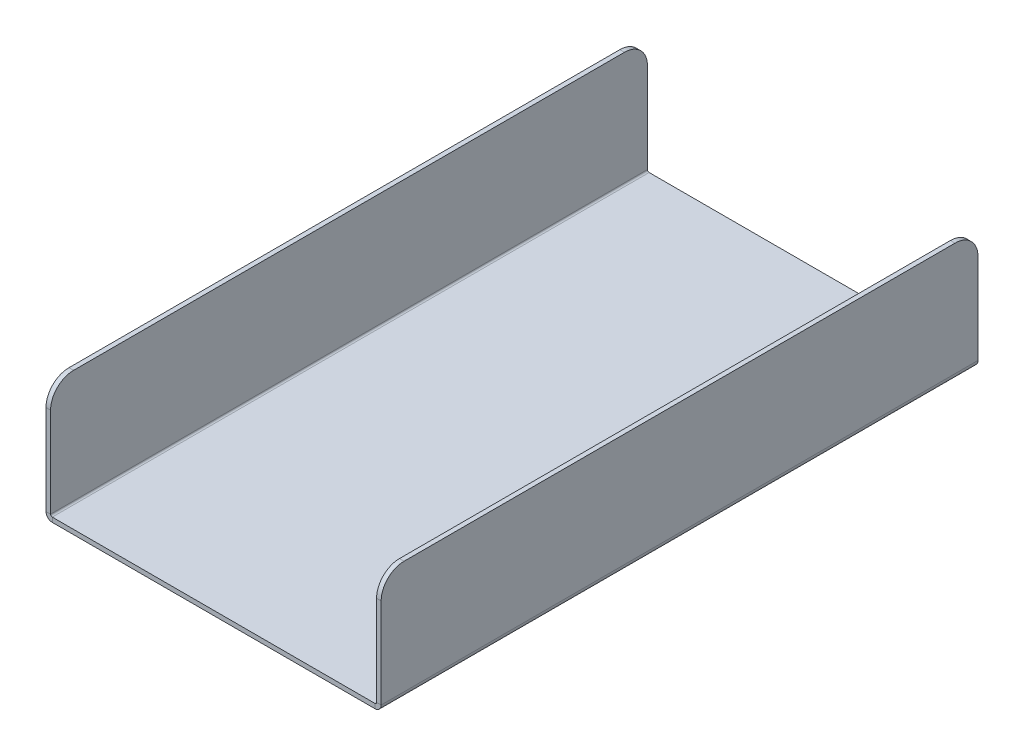
ISO-10303-21;
HEADER;
FILE_DESCRIPTION(('STEP AP214'),'2;1');
FILE_NAME('part.step','',(''),(''),'','','');
FILE_SCHEMA(('AUTOMOTIVE_DESIGN { 1 0 10303 214 1 1 1 1 }'));
ENDSEC;
DATA;
#1=APPLICATION_CONTEXT('core data for automotive mechanical design processes');
#2=APPLICATION_PROTOCOL_DEFINITION('international standard','automotive_design',2000,#1);
#3=PRODUCT_CONTEXT('',#1,'mechanical');
#4=PRODUCT('Part','Part','',(#3));
#5=PRODUCT_RELATED_PRODUCT_CATEGORY('part','',(#4));
#6=PRODUCT_DEFINITION_FORMATION('','',#4);
#7=PRODUCT_DEFINITION_CONTEXT('part definition',#1,'design');
#8=PRODUCT_DEFINITION('design','',#6,#7);
#9=PRODUCT_DEFINITION_SHAPE('','',#8);
#10=(LENGTH_UNIT() NAMED_UNIT(*) SI_UNIT(.MILLI.,.METRE.));
#11=(NAMED_UNIT(*) PLANE_ANGLE_UNIT() SI_UNIT($,.RADIAN.));
#12=(NAMED_UNIT(*) SI_UNIT($,.STERADIAN.) SOLID_ANGLE_UNIT());
#13=UNCERTAINTY_MEASURE_WITH_UNIT(LENGTH_MEASURE(1.E-05),#10,'distance_accuracy_value','');
#14=(GEOMETRIC_REPRESENTATION_CONTEXT(3) GLOBAL_UNCERTAINTY_ASSIGNED_CONTEXT((#13)) GLOBAL_UNIT_ASSIGNED_CONTEXT((#10,
#11,#12)) REPRESENTATION_CONTEXT('',''));
#15=CARTESIAN_POINT('',(0.,0.,0.));
#16=DIRECTION('',(0.,0.,1.));
#17=DIRECTION('',(1.,0.,0.));
#18=AXIS2_PLACEMENT_3D('',#15,#16,#17);
#19=CARTESIAN_POINT('',(-141.2634,0.,260.));
#20=DIRECTION('',(0.,0.,1.));
#21=DIRECTION('',(1.,0.,0.));
#22=AXIS2_PLACEMENT_3D('',#19,#20,#21);
#23=PLANE('',#22);
#24=DIRECTION('',(0.,-1.,0.));
#25=VECTOR('',#24,1.);
#26=CARTESIAN_POINT('',(-141.2634,0.,260.));
#27=LINE('',#26,#25);
#28=CARTESIAN_POINT('',(-141.2634,0.,260.));
#29=VERTEX_POINT('',#28);
#30=CARTESIAN_POINT('',(-141.2634,-2.,260.));
#31=VERTEX_POINT('',#30);
#32=EDGE_CURVE('E275',#29,#31,#27,.T.);
#33=ORIENTED_EDGE('',*,*,#32,.F.);
#34=CARTESIAN_POINT('',(-141.2634,0.736599999999998,260.));
#35=DIRECTION('',(0.,0.,-1.));
#36=DIRECTION('',(-1.,0.,0.));
#37=AXIS2_PLACEMENT_3D('',#34,#35,#36);
#38=CIRCLE('',#37,0.7366);
#39=CARTESIAN_POINT('',(-142.,0.736599999999997,260.));
#40=VERTEX_POINT('',#39);
#41=EDGE_CURVE('E192',#40,#29,#38,.F.);
#42=ORIENTED_EDGE('',*,*,#41,.F.);
#43=DIRECTION('',(1.,0.,0.));
#44=VECTOR('',#43,1.);
#45=CARTESIAN_POINT('',(-144.,0.736599999999994,260.));
#46=LINE('',#45,#44);
#47=CARTESIAN_POINT('',(-144.,0.736599999999994,260.));
#48=VERTEX_POINT('',#47);
#49=EDGE_CURVE('E272',#48,#40,#46,.T.);
#50=ORIENTED_EDGE('',*,*,#49,.F.);
#51=CARTESIAN_POINT('',(-141.2634,0.736599999999998,260.));
#52=DIRECTION('',(0.,0.,1.));
#53=DIRECTION('',(1.,0.,0.));
#54=AXIS2_PLACEMENT_3D('',#51,#52,#53);
#55=CIRCLE('',#54,2.7366);
#56=EDGE_CURVE('E202',#48,#31,#55,.T.);
#57=ORIENTED_EDGE('',*,*,#56,.T.);
#58=EDGE_LOOP('',(#33,#42,#50,#57));
#59=FACE_BOUND('',#58,.T.);
#60=ADVANCED_FACE('F36',(#59),#23,.T.);
#61=CARTESIAN_POINT('',(-144.,0.736599999999994,260.));
#62=DIRECTION('',(0.,0.,1.));
#63=DIRECTION('',(1.,0.,0.));
#64=AXIS2_PLACEMENT_3D('',#61,#62,#63);
#65=PLANE('',#64);
#66=DIRECTION('',(1.,0.,0.));
#67=VECTOR('',#66,1.);
#68=CARTESIAN_POINT('',(-142.,0.,260.));
#69=LINE('',#68,#67);
#70=CARTESIAN_POINT('',(-0.736600000000004,0.,260.));
#71=VERTEX_POINT('',#70);
#72=EDGE_CURVE('E190',#29,#71,#69,.T.);
#73=ORIENTED_EDGE('',*,*,#72,.F.);
#74=ORIENTED_EDGE('',*,*,#32,.T.);
#75=DIRECTION('',(1.,0.,0.));
#76=VECTOR('',#75,1.);
#77=CARTESIAN_POINT('',(-142.,-2.,260.));
#78=LINE('',#77,#76);
#79=CARTESIAN_POINT('',(-0.73660000000001,-2.,260.));
#80=VERTEX_POINT('',#79);
#81=EDGE_CURVE('E205',#31,#80,#78,.T.);
#82=ORIENTED_EDGE('',*,*,#81,.T.);
#83=DIRECTION('',(0.,1.,0.));
#84=VECTOR('',#83,1.);
#85=CARTESIAN_POINT('',(-0.73660000000001,-2.,260.));
#86=LINE('',#85,#84);
#87=EDGE_CURVE('E164',#80,#71,#86,.T.);
#88=ORIENTED_EDGE('',*,*,#87,.T.);
#89=EDGE_LOOP('',(#73,#74,#82,#88));
#90=FACE_BOUND('',#89,.T.);
#91=ADVANCED_FACE('F343',(#90),#65,.T.);
#92=CARTESIAN_POINT('',(-142.,0.736599999999997,0.));
#93=DIRECTION('',(0.,0.,-1.));
#94=DIRECTION('',(-1.,0.,0.));
#95=AXIS2_PLACEMENT_3D('',#92,#93,#94);
#96=PLANE('',#95);
#97=DIRECTION('',(-1.,0.,0.));
#98=VECTOR('',#97,1.);
#99=CARTESIAN_POINT('',(-142.,0.736599999999997,0.));
#100=LINE('',#99,#98);
#101=CARTESIAN_POINT('',(-142.,0.736599999999997,0.));
#102=VERTEX_POINT('',#101);
#103=CARTESIAN_POINT('',(-144.,0.736599999999994,0.));
#104=VERTEX_POINT('',#103);
#105=EDGE_CURVE('E269',#102,#104,#100,.T.);
#106=ORIENTED_EDGE('',*,*,#105,.F.);
#107=CARTESIAN_POINT('',(-141.2634,0.736599999999998,0.));
#108=DIRECTION('',(0.,0.,-1.));
#109=DIRECTION('',(-1.,0.,0.));
#110=AXIS2_PLACEMENT_3D('',#107,#108,#109);
#111=CIRCLE('',#110,0.7366);
#112=CARTESIAN_POINT('',(-141.2634,0.,0.));
#113=VERTEX_POINT('',#112);
#114=EDGE_CURVE('E219',#102,#113,#111,.F.);
#115=ORIENTED_EDGE('',*,*,#114,.T.);
#116=DIRECTION('',(0.,1.,0.));
#117=VECTOR('',#116,1.);
#118=CARTESIAN_POINT('',(-141.2634,-2.,0.));
#119=LINE('',#118,#117);
#120=CARTESIAN_POINT('',(-141.2634,-2.,0.));
#121=VERTEX_POINT('',#120);
#122=EDGE_CURVE('E163',#121,#113,#119,.T.);
#123=ORIENTED_EDGE('',*,*,#122,.F.);
#124=CARTESIAN_POINT('',(-141.2634,0.736599999999998,0.));
#125=DIRECTION('',(0.,0.,1.));
#126=DIRECTION('',(1.,0.,0.));
#127=AXIS2_PLACEMENT_3D('',#124,#125,#126);
#128=CIRCLE('',#127,2.7366);
#129=EDGE_CURVE('E226',#104,#121,#128,.T.);
#130=ORIENTED_EDGE('',*,*,#129,.F.);
#131=EDGE_LOOP('',(#106,#115,#123,#130));
#132=FACE_BOUND('',#131,.T.);
#133=ADVANCED_FACE('F331',(#132),#96,.T.);
#134=CARTESIAN_POINT('',(-141.2634,-2.,0.));
#135=DIRECTION('',(0.,0.,-1.));
#136=DIRECTION('',(-1.,0.,0.));
#137=AXIS2_PLACEMENT_3D('',#134,#135,#136);
#138=PLANE('',#137);
#139=DIRECTION('',(0.,1.,0.));
#140=VECTOR('',#139,1.);
#141=CARTESIAN_POINT('',(-144.,50.,0.));
#142=LINE('',#141,#140);
#143=CARTESIAN_POINT('',(-144.,40.,0.));
#144=VERTEX_POINT('',#143);
#145=EDGE_CURVE('E224',#144,#104,#142,.F.);
#146=ORIENTED_EDGE('',*,*,#145,.F.);
#147=DIRECTION('',(1.,0.,0.));
#148=VECTOR('',#147,1.);
#149=CARTESIAN_POINT('',(-141.2634,40.,0.));
#150=LINE('',#149,#148);
#151=CARTESIAN_POINT('',(-142.,40.,0.));
#152=VERTEX_POINT('',#151);
#153=EDGE_CURVE('E11',#144,#152,#150,.T.);
#154=ORIENTED_EDGE('',*,*,#153,.T.);
#155=DIRECTION('',(0.,-1.,0.));
#156=VECTOR('',#155,1.);
#157=CARTESIAN_POINT('',(-142.,50.,0.));
#158=LINE('',#157,#156);
#159=EDGE_CURVE('E222',#152,#102,#158,.T.);
#160=ORIENTED_EDGE('',*,*,#159,.T.);
#161=ORIENTED_EDGE('',*,*,#105,.T.);
#162=EDGE_LOOP('',(#146,#154,#160,#161));
#163=FACE_BOUND('',#162,.T.);
#164=ADVANCED_FACE('F353',(#163),#138,.T.);
#165=CARTESIAN_POINT('',(0.,0.7366,260.));
#166=DIRECTION('',(0.,0.,1.));
#167=DIRECTION('',(1.,0.,0.));
#168=AXIS2_PLACEMENT_3D('',#165,#166,#167);
#169=PLANE('',#168);
#170=DIRECTION('',(1.,0.,0.));
#171=VECTOR('',#170,1.);
#172=CARTESIAN_POINT('',(0.,0.7366,260.));
#173=LINE('',#172,#171);
#174=CARTESIAN_POINT('',(0.,0.7366,260.));
#175=VERTEX_POINT('',#174);
#176=CARTESIAN_POINT('',(2.,0.7366,260.));
#177=VERTEX_POINT('',#176);
#178=EDGE_CURVE('E151',#175,#177,#173,.T.);
#179=ORIENTED_EDGE('',*,*,#178,.F.);
#180=CARTESIAN_POINT('',(-0.736600000000002,0.7366,260.));
#181=DIRECTION('',(0.,0.,-1.));
#182=DIRECTION('',(-1.,0.,0.));
#183=AXIS2_PLACEMENT_3D('',#180,#181,#182);
#184=CIRCLE('',#183,0.7366);
#185=EDGE_CURVE('E155',#71,#175,#184,.F.);
#186=ORIENTED_EDGE('',*,*,#185,.F.);
#187=ORIENTED_EDGE('',*,*,#87,.F.);
#188=CARTESIAN_POINT('',(-0.736600000000002,0.7366,260.));
#189=DIRECTION('',(0.,0.,1.));
#190=DIRECTION('',(1.,0.,0.));
#191=AXIS2_PLACEMENT_3D('',#188,#189,#190);
#192=CIRCLE('',#191,2.7366);
#193=EDGE_CURVE('E158',#80,#177,#192,.T.);
#194=ORIENTED_EDGE('',*,*,#193,.T.);
#195=EDGE_LOOP('',(#179,#186,#187,#194));
#196=FACE_BOUND('',#195,.T.);
#197=ADVANCED_FACE('F153',(#196),#169,.T.);
#198=CARTESIAN_POINT('',(-0.73660000000001,-2.,260.));
#199=DIRECTION('',(0.,0.,1.));
#200=DIRECTION('',(1.,0.,0.));
#201=AXIS2_PLACEMENT_3D('',#198,#199,#200);
#202=PLANE('',#201);
#203=DIRECTION('',(0.,1.,0.));
#204=VECTOR('',#203,1.);
#205=CARTESIAN_POINT('',(2.,0.,260.));
#206=LINE('',#205,#204);
#207=CARTESIAN_POINT('',(2.,40.,260.));
#208=VERTEX_POINT('',#207);
#209=EDGE_CURVE('E185',#177,#208,#206,.T.);
#210=ORIENTED_EDGE('',*,*,#209,.T.);
#211=DIRECTION('',(1.,0.,0.));
#212=VECTOR('',#211,1.);
#213=CARTESIAN_POINT('',(-0.73660000000001,40.,260.));
#214=LINE('',#213,#212);
#215=CARTESIAN_POINT('',(0.,40.,260.));
#216=VERTEX_POINT('',#215);
#217=EDGE_CURVE('E184',#208,#216,#214,.F.);
#218=ORIENTED_EDGE('',*,*,#217,.T.);
#219=DIRECTION('',(0.,1.,0.));
#220=VECTOR('',#219,1.);
#221=CARTESIAN_POINT('',(0.,0.,260.));
#222=LINE('',#221,#220);
#223=EDGE_CURVE('E172',#175,#216,#222,.T.);
#224=ORIENTED_EDGE('',*,*,#223,.F.);
#225=ORIENTED_EDGE('',*,*,#178,.T.);
#226=EDGE_LOOP('',(#210,#218,#224,#225));
#227=FACE_BOUND('',#226,.T.);
#228=ADVANCED_FACE('F182',(#227),#202,.T.);
#229=CARTESIAN_POINT('',(-0.736600000000004,0.,0.));
#230=DIRECTION('',(0.,0.,-1.));
#231=DIRECTION('',(-1.,0.,0.));
#232=AXIS2_PLACEMENT_3D('',#229,#230,#231);
#233=PLANE('',#232);
#234=DIRECTION('',(0.,-1.,0.));
#235=VECTOR('',#234,1.);
#236=CARTESIAN_POINT('',(-0.736600000000004,0.,0.));
#237=LINE('',#236,#235);
#238=CARTESIAN_POINT('',(-0.736600000000004,0.,0.));
#239=VERTEX_POINT('',#238);
#240=CARTESIAN_POINT('',(-0.73660000000001,-2.,0.));
#241=VERTEX_POINT('',#240);
#242=EDGE_CURVE('E265',#239,#241,#237,.T.);
#243=ORIENTED_EDGE('',*,*,#242,.F.);
#244=CARTESIAN_POINT('',(-0.736600000000002,0.7366,0.));
#245=DIRECTION('',(0.,0.,-1.));
#246=DIRECTION('',(-1.,0.,0.));
#247=AXIS2_PLACEMENT_3D('',#244,#245,#246);
#248=CIRCLE('',#247,0.7366);
#249=CARTESIAN_POINT('',(0.,0.7366,0.));
#250=VERTEX_POINT('',#249);
#251=EDGE_CURVE('E214',#239,#250,#248,.F.);
#252=ORIENTED_EDGE('',*,*,#251,.T.);
#253=DIRECTION('',(-1.,0.,0.));
#254=VECTOR('',#253,1.);
#255=CARTESIAN_POINT('',(2.,0.7366,0.));
#256=LINE('',#255,#254);
#257=CARTESIAN_POINT('',(2.,0.7366,0.));
#258=VERTEX_POINT('',#257);
#259=EDGE_CURVE('E263',#258,#250,#256,.T.);
#260=ORIENTED_EDGE('',*,*,#259,.F.);
#261=CARTESIAN_POINT('',(-0.736600000000002,0.7366,0.));
#262=DIRECTION('',(0.,0.,1.));
#263=DIRECTION('',(1.,0.,0.));
#264=AXIS2_PLACEMENT_3D('',#261,#262,#263);
#265=CIRCLE('',#264,2.7366);
#266=EDGE_CURVE('E232',#241,#258,#265,.T.);
#267=ORIENTED_EDGE('',*,*,#266,.F.);
#268=EDGE_LOOP('',(#243,#252,#260,#267));
#269=FACE_BOUND('',#268,.T.);
#270=ADVANCED_FACE('F319',(#269),#233,.T.);
#271=CARTESIAN_POINT('',(2.,0.7366,0.));
#272=DIRECTION('',(0.,0.,-1.));
#273=DIRECTION('',(-1.,0.,0.));
#274=AXIS2_PLACEMENT_3D('',#271,#272,#273);
#275=PLANE('',#274);
#276=DIRECTION('',(1.,0.,0.));
#277=VECTOR('',#276,1.);
#278=CARTESIAN_POINT('',(-142.,0.,0.));
#279=LINE('',#278,#277);
#280=EDGE_CURVE('E216',#113,#239,#279,.T.);
#281=ORIENTED_EDGE('',*,*,#280,.T.);
#282=ORIENTED_EDGE('',*,*,#242,.T.);
#283=DIRECTION('',(1.,0.,0.));
#284=VECTOR('',#283,1.);
#285=CARTESIAN_POINT('',(-142.,-2.,0.));
#286=LINE('',#285,#284);
#287=EDGE_CURVE('E229',#121,#241,#286,.T.);
#288=ORIENTED_EDGE('',*,*,#287,.F.);
#289=ORIENTED_EDGE('',*,*,#122,.T.);
#290=EDGE_LOOP('',(#281,#282,#288,#289));
#291=FACE_BOUND('',#290,.T.);
#292=ADVANCED_FACE('F322',(#291),#275,.T.);
#293=CARTESIAN_POINT('',(2.,0.,260.));
#294=DIRECTION('',(-1.,0.,0.));
#295=DIRECTION('',(0.,0.,1.));
#296=AXIS2_PLACEMENT_3D('',#293,#294,#295);
#297=PLANE('',#296);
#298=DIRECTION('',(0.,0.,-1.));
#299=VECTOR('',#298,1.);
#300=CARTESIAN_POINT('',(2.,50.,260.));
#301=LINE('',#300,#299);
#302=CARTESIAN_POINT('',(2.,50.,250.));
#303=VERTEX_POINT('',#302);
#304=CARTESIAN_POINT('',(2.,50.,10.));
#305=VERTEX_POINT('',#304);
#306=EDGE_CURVE('E260',#303,#305,#301,.T.);
#307=ORIENTED_EDGE('',*,*,#306,.F.);
#308=CARTESIAN_POINT('',(2.,40.,250.));
#309=DIRECTION('',(-1.,0.,0.));
#310=DIRECTION('',(0.,0.,1.));
#311=AXIS2_PLACEMENT_3D('',#308,#309,#310);
#312=CIRCLE('',#311,10.);
#313=EDGE_CURVE('E284',#303,#208,#312,.F.);
#314=ORIENTED_EDGE('',*,*,#313,.T.);
#315=ORIENTED_EDGE('',*,*,#209,.F.);
#316=DIRECTION('',(0.,0.,-1.));
#317=VECTOR('',#316,1.);
#318=CARTESIAN_POINT('',(2.,0.7366,260.));
#319=LINE('',#318,#317);
#320=EDGE_CURVE('E209',#177,#258,#319,.T.);
#321=ORIENTED_EDGE('',*,*,#320,.T.);
#322=DIRECTION('',(0.,1.,0.));
#323=VECTOR('',#322,1.);
#324=CARTESIAN_POINT('',(2.,0.,0.));
#325=LINE('',#324,#323);
#326=CARTESIAN_POINT('',(2.,40.,0.));
#327=VERTEX_POINT('',#326);
#328=EDGE_CURVE('E210',#258,#327,#325,.T.);
#329=ORIENTED_EDGE('',*,*,#328,.T.);
#330=CARTESIAN_POINT('',(2.,40.,10.));
#331=DIRECTION('',(-1.,0.,0.));
#332=DIRECTION('',(0.,0.,1.));
#333=AXIS2_PLACEMENT_3D('',#330,#331,#332);
#334=CIRCLE('',#333,10.);
#335=EDGE_CURVE('E282',#327,#305,#334,.F.);
#336=ORIENTED_EDGE('',*,*,#335,.T.);
#337=EDGE_LOOP('',(#307,#314,#315,#321,#329,#336));
#338=FACE_BOUND('',#337,.T.);
#339=ADVANCED_FACE('F312',(#338),#297,.F.);
#340=CARTESIAN_POINT('',(0.,50.,260.));
#341=DIRECTION('',(0.,1.,0.));
#342=DIRECTION('',(0.,0.,1.));
#343=AXIS2_PLACEMENT_3D('',#340,#341,#342);
#344=PLANE('',#343);
#345=DIRECTION('',(0.,0.,-1.));
#346=VECTOR('',#345,1.);
#347=CARTESIAN_POINT('',(0.,50.,260.));
#348=LINE('',#347,#346);
#349=CARTESIAN_POINT('',(0.,50.,250.));
#350=VERTEX_POINT('',#349);
#351=CARTESIAN_POINT('',(0.,50.,10.));
#352=VERTEX_POINT('',#351);
#353=EDGE_CURVE('E179',#350,#352,#348,.T.);
#354=ORIENTED_EDGE('',*,*,#353,.F.);
#355=DIRECTION('',(1.,0.,0.));
#356=VECTOR('',#355,1.);
#357=CARTESIAN_POINT('',(0.,50.,250.));
#358=LINE('',#357,#356);
#359=EDGE_CURVE('E279',#350,#303,#358,.T.);
#360=ORIENTED_EDGE('',*,*,#359,.T.);
#361=ORIENTED_EDGE('',*,*,#306,.T.);
#362=DIRECTION('',(1.,0.,0.));
#363=VECTOR('',#362,1.);
#364=CARTESIAN_POINT('',(0.,50.,10.));
#365=LINE('',#364,#363);
#366=EDGE_CURVE('E277',#305,#352,#365,.F.);
#367=ORIENTED_EDGE('',*,*,#366,.T.);
#368=EDGE_LOOP('',(#354,#360,#361,#367));
#369=FACE_BOUND('',#368,.T.);
#370=ADVANCED_FACE('F393',(#369),#344,.T.);
#371=CARTESIAN_POINT('',(0.,0.,260.));
#372=DIRECTION('',(-1.,0.,0.));
#373=DIRECTION('',(0.,0.,1.));
#374=AXIS2_PLACEMENT_3D('',#371,#372,#373);
#375=PLANE('',#374);
#376=ORIENTED_EDGE('',*,*,#223,.T.);
#377=CARTESIAN_POINT('',(0.,40.,250.));
#378=DIRECTION('',(-1.,0.,0.));
#379=DIRECTION('',(0.,0.,1.));
#380=AXIS2_PLACEMENT_3D('',#377,#378,#379);
#381=CIRCLE('',#380,10.);
#382=EDGE_CURVE('E289',#216,#350,#381,.T.);
#383=ORIENTED_EDGE('',*,*,#382,.T.);
#384=ORIENTED_EDGE('',*,*,#353,.T.);
#385=CARTESIAN_POINT('',(0.,40.,10.));
#386=DIRECTION('',(-1.,0.,0.));
#387=DIRECTION('',(0.,0.,1.));
#388=AXIS2_PLACEMENT_3D('',#385,#386,#387);
#389=CIRCLE('',#388,10.);
#390=CARTESIAN_POINT('',(0.,40.,0.));
#391=VERTEX_POINT('',#390);
#392=EDGE_CURVE('E287',#352,#391,#389,.T.);
#393=ORIENTED_EDGE('',*,*,#392,.T.);
#394=DIRECTION('',(0.,1.,0.));
#395=VECTOR('',#394,1.);
#396=CARTESIAN_POINT('',(0.,0.,0.));
#397=LINE('',#396,#395);
#398=EDGE_CURVE('E175',#250,#391,#397,.T.);
#399=ORIENTED_EDGE('',*,*,#398,.F.);
#400=DIRECTION('',(0.,0.,-1.));
#401=VECTOR('',#400,1.);
#402=CARTESIAN_POINT('',(0.,0.7366,260.));
#403=LINE('',#402,#401);
#404=EDGE_CURVE('E170',#175,#250,#403,.T.);
#405=ORIENTED_EDGE('',*,*,#404,.F.);
#406=EDGE_LOOP('',(#376,#383,#384,#393,#399,#405));
#407=FACE_BOUND('',#406,.T.);
#408=ADVANCED_FACE('F171',(#407),#375,.T.);
#409=CARTESIAN_POINT('',(-0.736600000000002,0.7366,260.));
#410=DIRECTION('',(0.,0.,-1.));
#411=DIRECTION('',(-1.,0.,0.));
#412=AXIS2_PLACEMENT_3D('',#409,#410,#411);
#413=CYLINDRICAL_SURFACE('',#412,0.7366);
#414=ORIENTED_EDGE('',*,*,#251,.F.);
#415=DIRECTION('',(0.,0.,-1.));
#416=VECTOR('',#415,1.);
#417=CARTESIAN_POINT('',(-0.736600000000004,0.,260.));
#418=LINE('',#417,#416);
#419=EDGE_CURVE('E180',#71,#239,#418,.T.);
#420=ORIENTED_EDGE('',*,*,#419,.F.);
#421=ORIENTED_EDGE('',*,*,#185,.T.);
#422=ORIENTED_EDGE('',*,*,#404,.T.);
#423=EDGE_LOOP('',(#414,#420,#421,#422));
#424=FACE_BOUND('',#423,.T.);
#425=ADVANCED_FACE('F188',(#424),#413,.F.);
#426=CARTESIAN_POINT('',(-142.,0.,260.));
#427=DIRECTION('',(0.,1.,0.));
#428=DIRECTION('',(0.,0.,1.));
#429=AXIS2_PLACEMENT_3D('',#426,#427,#428);
#430=PLANE('',#429);
#431=ORIENTED_EDGE('',*,*,#280,.F.);
#432=DIRECTION('',(0.,0.,-1.));
#433=VECTOR('',#432,1.);
#434=CARTESIAN_POINT('',(-141.2634,0.,260.));
#435=LINE('',#434,#433);
#436=EDGE_CURVE('E254',#29,#113,#435,.T.);
#437=ORIENTED_EDGE('',*,*,#436,.F.);
#438=ORIENTED_EDGE('',*,*,#72,.T.);
#439=ORIENTED_EDGE('',*,*,#419,.T.);
#440=EDGE_LOOP('',(#431,#437,#438,#439));
#441=FACE_BOUND('',#440,.T.);
#442=ADVANCED_FACE('F326',(#441),#430,.T.);
#443=CARTESIAN_POINT('',(-141.2634,0.736599999999998,260.));
#444=DIRECTION('',(0.,0.,-1.));
#445=DIRECTION('',(-1.,0.,0.));
#446=AXIS2_PLACEMENT_3D('',#443,#444,#445);
#447=CYLINDRICAL_SURFACE('',#446,0.7366);
#448=ORIENTED_EDGE('',*,*,#114,.F.);
#449=DIRECTION('',(0.,0.,-1.));
#450=VECTOR('',#449,1.);
#451=CARTESIAN_POINT('',(-142.,0.736599999999997,260.));
#452=LINE('',#451,#450);
#453=EDGE_CURVE('E251',#40,#102,#452,.T.);
#454=ORIENTED_EDGE('',*,*,#453,.F.);
#455=ORIENTED_EDGE('',*,*,#41,.T.);
#456=ORIENTED_EDGE('',*,*,#436,.T.);
#457=EDGE_LOOP('',(#448,#454,#455,#456));
#458=FACE_BOUND('',#457,.T.);
#459=ADVANCED_FACE('F335',(#458),#447,.F.);
#460=CARTESIAN_POINT('',(-142.,50.,260.));
#461=DIRECTION('',(1.,0.,0.));
#462=DIRECTION('',(0.,0.,-1.));
#463=AXIS2_PLACEMENT_3D('',#460,#461,#462);
#464=PLANE('',#463);
#465=DIRECTION('',(0.,0.,-1.));
#466=VECTOR('',#465,1.);
#467=CARTESIAN_POINT('',(-142.,50.,260.));
#468=LINE('',#467,#466);
#469=CARTESIAN_POINT('',(-142.,50.,250.));
#470=VERTEX_POINT('',#469);
#471=CARTESIAN_POINT('',(-142.,50.,10.));
#472=VERTEX_POINT('',#471);
#473=EDGE_CURVE('E248',#470,#472,#468,.T.);
#474=ORIENTED_EDGE('',*,*,#473,.F.);
#475=CARTESIAN_POINT('',(-142.,40.,250.));
#476=DIRECTION('',(1.,0.,0.));
#477=DIRECTION('',(0.,0.,-1.));
#478=AXIS2_PLACEMENT_3D('',#475,#476,#477);
#479=CIRCLE('',#478,10.);
#480=CARTESIAN_POINT('',(-142.,40.,260.));
#481=VERTEX_POINT('',#480);
#482=EDGE_CURVE('E298',#470,#481,#479,.T.);
#483=ORIENTED_EDGE('',*,*,#482,.T.);
#484=DIRECTION('',(0.,-1.,0.));
#485=VECTOR('',#484,1.);
#486=CARTESIAN_POINT('',(-142.,50.,260.));
#487=LINE('',#486,#485);
#488=EDGE_CURVE('E198',#481,#40,#487,.T.);
#489=ORIENTED_EDGE('',*,*,#488,.T.);
#490=ORIENTED_EDGE('',*,*,#453,.T.);
#491=ORIENTED_EDGE('',*,*,#159,.F.);
#492=CARTESIAN_POINT('',(-142.,40.,10.));
#493=DIRECTION('',(1.,0.,0.));
#494=DIRECTION('',(0.,0.,-1.));
#495=AXIS2_PLACEMENT_3D('',#492,#493,#494);
#496=CIRCLE('',#495,10.);
#497=EDGE_CURVE('E296',#152,#472,#496,.T.);
#498=ORIENTED_EDGE('',*,*,#497,.T.);
#499=EDGE_LOOP('',(#474,#483,#489,#490,#491,#498));
#500=FACE_BOUND('',#499,.T.);
#501=ADVANCED_FACE('F357',(#500),#464,.T.);
#502=CARTESIAN_POINT('',(-144.,50.,260.));
#503=DIRECTION('',(0.,1.,0.));
#504=DIRECTION('',(0.,0.,1.));
#505=AXIS2_PLACEMENT_3D('',#502,#503,#504);
#506=PLANE('',#505);
#507=DIRECTION('',(0.,0.,-1.));
#508=VECTOR('',#507,1.);
#509=CARTESIAN_POINT('',(-144.,50.,260.));
#510=LINE('',#509,#508);
#511=CARTESIAN_POINT('',(-144.,50.,250.));
#512=VERTEX_POINT('',#511);
#513=CARTESIAN_POINT('',(-144.,50.,10.));
#514=VERTEX_POINT('',#513);
#515=EDGE_CURVE('E246',#512,#514,#510,.T.);
#516=ORIENTED_EDGE('',*,*,#515,.F.);
#517=DIRECTION('',(1.,0.,0.));
#518=VECTOR('',#517,1.);
#519=CARTESIAN_POINT('',(-142.,50.,250.));
#520=LINE('',#519,#518);
#521=EDGE_CURVE('E293',#512,#470,#520,.T.);
#522=ORIENTED_EDGE('',*,*,#521,.T.);
#523=ORIENTED_EDGE('',*,*,#473,.T.);
#524=DIRECTION('',(1.,0.,0.));
#525=VECTOR('',#524,1.);
#526=CARTESIAN_POINT('',(-144.,50.,10.));
#527=LINE('',#526,#525);
#528=EDGE_CURVE('E291',#472,#514,#527,.F.);
#529=ORIENTED_EDGE('',*,*,#528,.T.);
#530=EDGE_LOOP('',(#516,#522,#523,#529));
#531=FACE_BOUND('',#530,.T.);
#532=ADVANCED_FACE('F489',(#531),#506,.T.);
#533=CARTESIAN_POINT('',(-144.,50.,260.));
#534=DIRECTION('',(1.,0.,0.));
#535=DIRECTION('',(0.,0.,-1.));
#536=AXIS2_PLACEMENT_3D('',#533,#534,#535);
#537=PLANE('',#536);
#538=DIRECTION('',(0.,1.,0.));
#539=VECTOR('',#538,1.);
#540=CARTESIAN_POINT('',(-144.,50.,260.));
#541=LINE('',#540,#539);
#542=CARTESIAN_POINT('',(-144.,40.,260.));
#543=VERTEX_POINT('',#542);
#544=EDGE_CURVE('E200',#543,#48,#541,.F.);
#545=ORIENTED_EDGE('',*,*,#544,.F.);
#546=CARTESIAN_POINT('',(-144.,40.,250.));
#547=DIRECTION('',(1.,0.,0.));
#548=DIRECTION('',(0.,0.,-1.));
#549=AXIS2_PLACEMENT_3D('',#546,#547,#548);
#550=CIRCLE('',#549,10.);
#551=EDGE_CURVE('E302',#543,#512,#550,.F.);
#552=ORIENTED_EDGE('',*,*,#551,.T.);
#553=ORIENTED_EDGE('',*,*,#515,.T.);
#554=CARTESIAN_POINT('',(-144.,40.,10.));
#555=DIRECTION('',(1.,0.,0.));
#556=DIRECTION('',(0.,0.,-1.));
#557=AXIS2_PLACEMENT_3D('',#554,#555,#556);
#558=CIRCLE('',#557,10.);
#559=EDGE_CURVE('E51',#514,#144,#558,.F.);
#560=ORIENTED_EDGE('',*,*,#559,.T.);
#561=ORIENTED_EDGE('',*,*,#145,.T.);
#562=DIRECTION('',(0.,0.,-1.));
#563=VECTOR('',#562,1.);
#564=CARTESIAN_POINT('',(-144.,0.736599999999994,260.));
#565=LINE('',#564,#563);
#566=EDGE_CURVE('E243',#48,#104,#565,.T.);
#567=ORIENTED_EDGE('',*,*,#566,.F.);
#568=EDGE_LOOP('',(#545,#552,#553,#560,#561,#567));
#569=FACE_BOUND('',#568,.T.);
#570=ADVANCED_FACE('F349',(#569),#537,.F.);
#571=CARTESIAN_POINT('',(-141.2634,0.736599999999998,260.));
#572=DIRECTION('',(0.,0.,-1.));
#573=DIRECTION('',(-1.,0.,0.));
#574=AXIS2_PLACEMENT_3D('',#571,#572,#573);
#575=CYLINDRICAL_SURFACE('',#574,2.7366);
#576=ORIENTED_EDGE('',*,*,#129,.T.);
#577=DIRECTION('',(0.,0.,-1.));
#578=VECTOR('',#577,1.);
#579=CARTESIAN_POINT('',(-141.2634,-2.,260.));
#580=LINE('',#579,#578);
#581=EDGE_CURVE('E240',#31,#121,#580,.T.);
#582=ORIENTED_EDGE('',*,*,#581,.F.);
#583=ORIENTED_EDGE('',*,*,#56,.F.);
#584=ORIENTED_EDGE('',*,*,#566,.T.);
#585=EDGE_LOOP('',(#576,#582,#583,#584));
#586=FACE_BOUND('',#585,.T.);
#587=ADVANCED_FACE('F348',(#586),#575,.T.);
#588=CARTESIAN_POINT('',(-142.,-2.,260.));
#589=DIRECTION('',(0.,1.,0.));
#590=DIRECTION('',(0.,0.,1.));
#591=AXIS2_PLACEMENT_3D('',#588,#589,#590);
#592=PLANE('',#591);
#593=ORIENTED_EDGE('',*,*,#287,.T.);
#594=DIRECTION('',(0.,0.,-1.));
#595=VECTOR('',#594,1.);
#596=CARTESIAN_POINT('',(-0.73660000000001,-2.,260.));
#597=LINE('',#596,#595);
#598=EDGE_CURVE('E237',#80,#241,#597,.T.);
#599=ORIENTED_EDGE('',*,*,#598,.F.);
#600=ORIENTED_EDGE('',*,*,#81,.F.);
#601=ORIENTED_EDGE('',*,*,#581,.T.);
#602=EDGE_LOOP('',(#593,#599,#600,#601));
#603=FACE_BOUND('',#602,.T.);
#604=ADVANCED_FACE('F346',(#603),#592,.F.);
#605=CARTESIAN_POINT('',(-0.736600000000002,0.7366,260.));
#606=DIRECTION('',(0.,0.,-1.));
#607=DIRECTION('',(-1.,0.,0.));
#608=AXIS2_PLACEMENT_3D('',#605,#606,#607);
#609=CYLINDRICAL_SURFACE('',#608,2.7366);
#610=ORIENTED_EDGE('',*,*,#266,.T.);
#611=ORIENTED_EDGE('',*,*,#320,.F.);
#612=ORIENTED_EDGE('',*,*,#193,.F.);
#613=ORIENTED_EDGE('',*,*,#598,.T.);
#614=EDGE_LOOP('',(#610,#611,#612,#613));
#615=FACE_BOUND('',#614,.T.);
#616=ADVANCED_FACE('F315',(#615),#609,.T.);
#617=CARTESIAN_POINT('',(-0.736600000000002,0.7366,260.));
#618=DIRECTION('',(0.,0.,-1.));
#619=DIRECTION('',(-1.,0.,0.));
#620=AXIS2_PLACEMENT_3D('',#617,#618,#619);
#621=PLANE('',#620);
#622=ORIENTED_EDGE('',*,*,#488,.F.);
#623=DIRECTION('',(1.,0.,0.));
#624=VECTOR('',#623,1.);
#625=CARTESIAN_POINT('',(-144.,40.,260.));
#626=LINE('',#625,#624);
#627=EDGE_CURVE('E59',#481,#543,#626,.F.);
#628=ORIENTED_EDGE('',*,*,#627,.T.);
#629=ORIENTED_EDGE('',*,*,#544,.T.);
#630=ORIENTED_EDGE('',*,*,#49,.T.);
#631=EDGE_LOOP('',(#622,#628,#629,#630));
#632=FACE_BOUND('',#631,.T.);
#633=ADVANCED_FACE('F358',(#632),#621,.F.);
#634=CARTESIAN_POINT('',(-0.736600000000002,0.7366,0.));
#635=DIRECTION('',(0.,0.,-1.));
#636=DIRECTION('',(-1.,0.,0.));
#637=AXIS2_PLACEMENT_3D('',#634,#635,#636);
#638=PLANE('',#637);
#639=ORIENTED_EDGE('',*,*,#398,.T.);
#640=DIRECTION('',(1.,0.,0.));
#641=VECTOR('',#640,1.);
#642=CARTESIAN_POINT('',(-0.736600000000002,40.,0.));
#643=LINE('',#642,#641);
#644=EDGE_CURVE('E44',#391,#327,#643,.T.);
#645=ORIENTED_EDGE('',*,*,#644,.T.);
#646=ORIENTED_EDGE('',*,*,#328,.F.);
#647=ORIENTED_EDGE('',*,*,#259,.T.);
#648=EDGE_LOOP('',(#639,#645,#646,#647));
#649=FACE_BOUND('',#648,.T.);
#650=ADVANCED_FACE('F307',(#649),#638,.T.);
#651=CARTESIAN_POINT('',(0.,40.,250.));
#652=DIRECTION('',(1.,0.,0.));
#653=DIRECTION('',(0.,0.,-1.));
#654=AXIS2_PLACEMENT_3D('',#651,#652,#653);
#655=CYLINDRICAL_SURFACE('',#654,10.);
#656=ORIENTED_EDGE('',*,*,#382,.F.);
#657=ORIENTED_EDGE('',*,*,#217,.F.);
#658=ORIENTED_EDGE('',*,*,#313,.F.);
#659=ORIENTED_EDGE('',*,*,#359,.F.);
#660=EDGE_LOOP('',(#656,#657,#658,#659));
#661=FACE_BOUND('',#660,.T.);
#662=ADVANCED_FACE('F365',(#661),#655,.T.);
#663=CARTESIAN_POINT('',(-144.,40.,250.));
#664=DIRECTION('',(-1.,0.,0.));
#665=DIRECTION('',(0.,0.,1.));
#666=AXIS2_PLACEMENT_3D('',#663,#664,#665);
#667=CYLINDRICAL_SURFACE('',#666,10.);
#668=ORIENTED_EDGE('',*,*,#551,.F.);
#669=ORIENTED_EDGE('',*,*,#627,.F.);
#670=ORIENTED_EDGE('',*,*,#482,.F.);
#671=ORIENTED_EDGE('',*,*,#521,.F.);
#672=EDGE_LOOP('',(#668,#669,#670,#671));
#673=FACE_BOUND('',#672,.T.);
#674=ADVANCED_FACE('F379',(#673),#667,.T.);
#675=CARTESIAN_POINT('',(-0.736600000000002,40.,10.));
#676=DIRECTION('',(1.,0.,0.));
#677=DIRECTION('',(0.,0.,-1.));
#678=AXIS2_PLACEMENT_3D('',#675,#676,#677);
#679=CYLINDRICAL_SURFACE('',#678,10.);
#680=ORIENTED_EDGE('',*,*,#392,.F.);
#681=ORIENTED_EDGE('',*,*,#366,.F.);
#682=ORIENTED_EDGE('',*,*,#335,.F.);
#683=ORIENTED_EDGE('',*,*,#644,.F.);
#684=EDGE_LOOP('',(#680,#681,#682,#683));
#685=FACE_BOUND('',#684,.T.);
#686=ADVANCED_FACE('F382',(#685),#679,.T.);
#687=CARTESIAN_POINT('',(-141.2634,40.,10.));
#688=DIRECTION('',(1.,0.,0.));
#689=DIRECTION('',(0.,0.,-1.));
#690=AXIS2_PLACEMENT_3D('',#687,#688,#689);
#691=CYLINDRICAL_SURFACE('',#690,10.);
#692=ORIENTED_EDGE('',*,*,#559,.F.);
#693=ORIENTED_EDGE('',*,*,#528,.F.);
#694=ORIENTED_EDGE('',*,*,#497,.F.);
#695=ORIENTED_EDGE('',*,*,#153,.F.);
#696=EDGE_LOOP('',(#692,#693,#694,#695));
#697=FACE_BOUND('',#696,.T.);
#698=ADVANCED_FACE('F38',(#697),#691,.T.);
#699=CLOSED_SHELL('',(#60,#91,#133,#164,#197,#228,#270,#292,#339,#370,#408,#425,#442,#459,#501,
#532,#570,#587,#604,#616,#633,#650,#662,#674,#686,#698));
#700=MANIFOLD_SOLID_BREP('B2',#699);
#701=ADVANCED_BREP_SHAPE_REPRESENTATION('',(#18,#700),#14);
#702=SHAPE_DEFINITION_REPRESENTATION(#9,#701);
ENDSEC;
END-ISO-10303-21;
